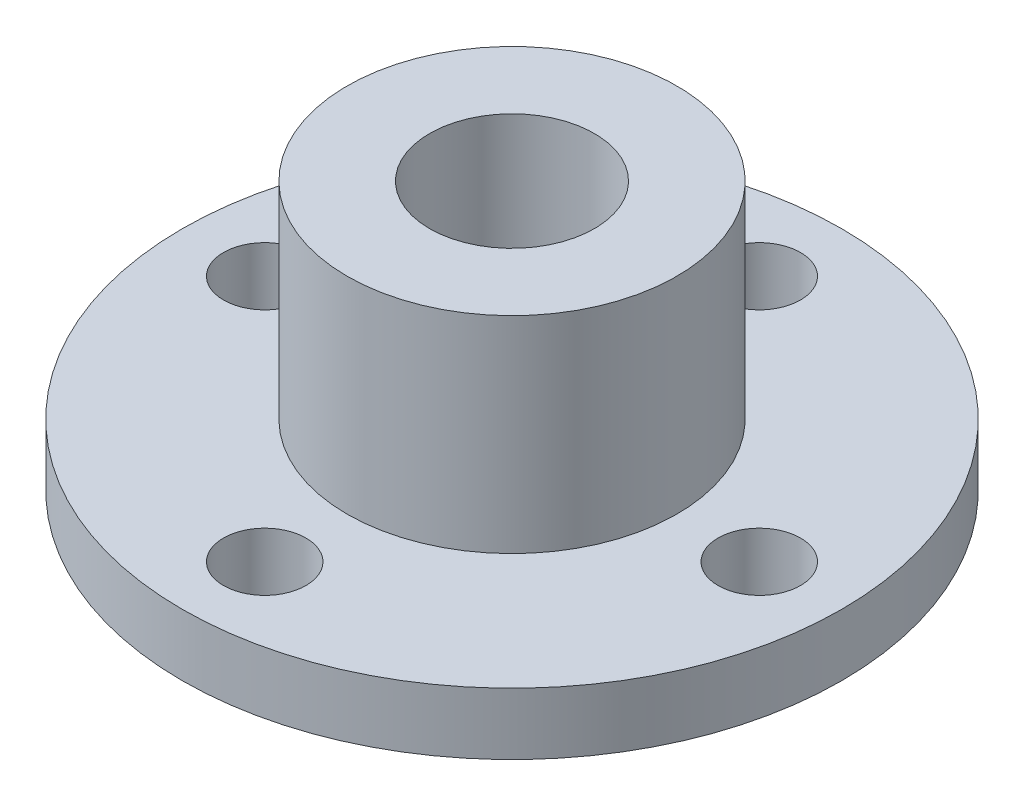
ISO-10303-21;
HEADER;
FILE_DESCRIPTION(('STEP AP214'),'2;1');
FILE_NAME('part.step','',(''),(''),'','','');
FILE_SCHEMA(('AUTOMOTIVE_DESIGN { 1 0 10303 214 1 1 1 1 }'));
ENDSEC;
DATA;
#1=APPLICATION_CONTEXT('core data for automotive mechanical design processes');
#2=APPLICATION_PROTOCOL_DEFINITION('international standard','automotive_design',2000,#1);
#3=PRODUCT_CONTEXT('',#1,'mechanical');
#4=PRODUCT('Part','Part','',(#3));
#5=PRODUCT_RELATED_PRODUCT_CATEGORY('part','',(#4));
#6=PRODUCT_DEFINITION_FORMATION('','',#4);
#7=PRODUCT_DEFINITION_CONTEXT('part definition',#1,'design');
#8=PRODUCT_DEFINITION('design','',#6,#7);
#9=PRODUCT_DEFINITION_SHAPE('','',#8);
#10=(LENGTH_UNIT() NAMED_UNIT(*) SI_UNIT(.MILLI.,.METRE.));
#11=(NAMED_UNIT(*) PLANE_ANGLE_UNIT() SI_UNIT($,.RADIAN.));
#12=(NAMED_UNIT(*) SI_UNIT($,.STERADIAN.) SOLID_ANGLE_UNIT());
#13=UNCERTAINTY_MEASURE_WITH_UNIT(LENGTH_MEASURE(1.E-05),#10,'distance_accuracy_value','');
#14=(GEOMETRIC_REPRESENTATION_CONTEXT(3) GLOBAL_UNCERTAINTY_ASSIGNED_CONTEXT((#13)) GLOBAL_UNIT_ASSIGNED_CONTEXT((#10,
#11,#12)) REPRESENTATION_CONTEXT('',''));
#15=CARTESIAN_POINT('',(0.,0.,0.));
#16=DIRECTION('',(0.,0.,1.));
#17=DIRECTION('',(1.,0.,0.));
#18=AXIS2_PLACEMENT_3D('',#15,#16,#17);
#19=CARTESIAN_POINT('',(0.,3.,-12.));
#20=DIRECTION('',(0.,-1.,0.));
#21=DIRECTION('',(0.,0.,-1.));
#22=AXIS2_PLACEMENT_3D('',#19,#20,#21);
#23=CYLINDRICAL_SURFACE('',#22,2.);
#24=CARTESIAN_POINT('',(0.,3.,-12.));
#25=DIRECTION('',(0.,1.,0.));
#26=DIRECTION('',(0.,0.,1.));
#27=AXIS2_PLACEMENT_3D('',#24,#25,#26);
#28=CIRCLE('',#27,2.);
#29=CARTESIAN_POINT('',(0.,3.,-10.));
#30=VERTEX_POINT('',#29);
#31=EDGE_CURVE('E44',#30,#30,#28,.T.);
#32=ORIENTED_EDGE('',*,*,#31,.T.);
#33=EDGE_LOOP('',(#32));
#34=FACE_BOUND('',#33,.T.);
#35=CARTESIAN_POINT('',(0.,0.,-12.));
#36=DIRECTION('',(0.,1.,0.));
#37=DIRECTION('',(0.,0.,1.));
#38=AXIS2_PLACEMENT_3D('',#35,#36,#37);
#39=CIRCLE('',#38,2.);
#40=CARTESIAN_POINT('',(0.,0.,-10.));
#41=VERTEX_POINT('',#40);
#42=EDGE_CURVE('E51',#41,#41,#39,.T.);
#43=ORIENTED_EDGE('',*,*,#42,.F.);
#44=EDGE_LOOP('',(#43));
#45=FACE_BOUND('',#44,.T.);
#46=ADVANCED_FACE('F32',(#34,#45),#23,.F.);
#47=CARTESIAN_POINT('',(12.,3.,0.));
#48=DIRECTION('',(0.,-1.,0.));
#49=DIRECTION('',(0.,0.,-1.));
#50=AXIS2_PLACEMENT_3D('',#47,#48,#49);
#51=CYLINDRICAL_SURFACE('',#50,2.);
#52=CARTESIAN_POINT('',(12.,3.,0.));
#53=DIRECTION('',(0.,1.,0.));
#54=DIRECTION('',(0.,0.,1.));
#55=AXIS2_PLACEMENT_3D('',#52,#53,#54);
#56=CIRCLE('',#55,2.);
#57=CARTESIAN_POINT('',(12.,3.,2.));
#58=VERTEX_POINT('',#57);
#59=EDGE_CURVE('E63',#58,#58,#56,.T.);
#60=ORIENTED_EDGE('',*,*,#59,.T.);
#61=EDGE_LOOP('',(#60));
#62=FACE_BOUND('',#61,.T.);
#63=CARTESIAN_POINT('',(12.,0.,0.));
#64=DIRECTION('',(0.,1.,0.));
#65=DIRECTION('',(0.,0.,1.));
#66=AXIS2_PLACEMENT_3D('',#63,#64,#65);
#67=CIRCLE('',#66,2.);
#68=CARTESIAN_POINT('',(12.,0.,2.));
#69=VERTEX_POINT('',#68);
#70=EDGE_CURVE('E54',#69,#69,#67,.T.);
#71=ORIENTED_EDGE('',*,*,#70,.F.);
#72=EDGE_LOOP('',(#71));
#73=FACE_BOUND('',#72,.T.);
#74=ADVANCED_FACE('F99',(#62,#73),#51,.F.);
#75=CARTESIAN_POINT('',(0.,3.,0.));
#76=DIRECTION('',(0.,-1.,0.));
#77=DIRECTION('',(0.,0.,-1.));
#78=AXIS2_PLACEMENT_3D('',#75,#76,#77);
#79=CYLINDRICAL_SURFACE('',#78,16.);
#80=CARTESIAN_POINT('',(0.,3.,0.));
#81=DIRECTION('',(0.,1.,0.));
#82=DIRECTION('',(0.,0.,1.));
#83=AXIS2_PLACEMENT_3D('',#80,#81,#82);
#84=CIRCLE('',#83,16.);
#85=CARTESIAN_POINT('',(0.,3.,16.));
#86=VERTEX_POINT('',#85);
#87=EDGE_CURVE('E50',#86,#86,#84,.T.);
#88=ORIENTED_EDGE('',*,*,#87,.F.);
#89=EDGE_LOOP('',(#88));
#90=FACE_BOUND('',#89,.T.);
#91=CARTESIAN_POINT('',(0.,0.,0.));
#92=DIRECTION('',(0.,1.,0.));
#93=DIRECTION('',(0.,0.,1.));
#94=AXIS2_PLACEMENT_3D('',#91,#92,#93);
#95=CIRCLE('',#94,16.);
#96=CARTESIAN_POINT('',(0.,0.,16.));
#97=VERTEX_POINT('',#96);
#98=EDGE_CURVE('E57',#97,#97,#95,.T.);
#99=ORIENTED_EDGE('',*,*,#98,.T.);
#100=EDGE_LOOP('',(#99));
#101=FACE_BOUND('',#100,.T.);
#102=ADVANCED_FACE('F34',(#90,#101),#79,.T.);
#103=CARTESIAN_POINT('',(-12.,3.,0.));
#104=DIRECTION('',(0.,-1.,0.));
#105=DIRECTION('',(0.,0.,-1.));
#106=AXIS2_PLACEMENT_3D('',#103,#104,#105);
#107=CYLINDRICAL_SURFACE('',#106,2.);
#108=CARTESIAN_POINT('',(-12.,3.,0.));
#109=DIRECTION('',(0.,1.,0.));
#110=DIRECTION('',(0.,0.,1.));
#111=AXIS2_PLACEMENT_3D('',#108,#109,#110);
#112=CIRCLE('',#111,2.);
#113=CARTESIAN_POINT('',(-12.,3.,2.));
#114=VERTEX_POINT('',#113);
#115=EDGE_CURVE('E40',#114,#114,#112,.T.);
#116=ORIENTED_EDGE('',*,*,#115,.T.);
#117=EDGE_LOOP('',(#116));
#118=FACE_BOUND('',#117,.T.);
#119=CARTESIAN_POINT('',(-12.,0.,0.));
#120=DIRECTION('',(0.,1.,0.));
#121=DIRECTION('',(0.,0.,1.));
#122=AXIS2_PLACEMENT_3D('',#119,#120,#121);
#123=CIRCLE('',#122,2.);
#124=CARTESIAN_POINT('',(-12.,0.,2.));
#125=VERTEX_POINT('',#124);
#126=EDGE_CURVE('E47',#125,#125,#123,.T.);
#127=ORIENTED_EDGE('',*,*,#126,.F.);
#128=EDGE_LOOP('',(#127));
#129=FACE_BOUND('',#128,.T.);
#130=ADVANCED_FACE('F108',(#118,#129),#107,.F.);
#131=CARTESIAN_POINT('',(0.,3.,0.));
#132=DIRECTION('',(0.,1.,0.));
#133=DIRECTION('',(0.,0.,1.));
#134=AXIS2_PLACEMENT_3D('',#131,#132,#133);
#135=PLANE('',#134);
#136=CARTESIAN_POINT('',(0.,3.,12.));
#137=DIRECTION('',(0.,1.,0.));
#138=DIRECTION('',(0.,0.,1.));
#139=AXIS2_PLACEMENT_3D('',#136,#137,#138);
#140=CIRCLE('',#139,2.);
#141=CARTESIAN_POINT('',(0.,3.,14.));
#142=VERTEX_POINT('',#141);
#143=EDGE_CURVE('E76',#142,#142,#140,.T.);
#144=ORIENTED_EDGE('',*,*,#143,.F.);
#145=EDGE_LOOP('',(#144));
#146=FACE_BOUND('',#145,.T.);
#147=CARTESIAN_POINT('',(0.,3.,0.));
#148=DIRECTION('',(0.,1.,0.));
#149=DIRECTION('',(0.,0.,1.));
#150=AXIS2_PLACEMENT_3D('',#147,#148,#149);
#151=CIRCLE('',#150,8.);
#152=CARTESIAN_POINT('',(0.,3.,8.));
#153=VERTEX_POINT('',#152);
#154=EDGE_CURVE('E68',#153,#153,#151,.T.);
#155=ORIENTED_EDGE('',*,*,#154,.F.);
#156=EDGE_LOOP('',(#155));
#157=FACE_BOUND('',#156,.T.);
#158=ORIENTED_EDGE('',*,*,#87,.T.);
#159=EDGE_LOOP('',(#158));
#160=FACE_BOUND('',#159,.T.);
#161=ORIENTED_EDGE('',*,*,#59,.F.);
#162=EDGE_LOOP('',(#161));
#163=FACE_BOUND('',#162,.T.);
#164=ORIENTED_EDGE('',*,*,#31,.F.);
#165=EDGE_LOOP('',(#164));
#166=FACE_BOUND('',#165,.T.);
#167=ORIENTED_EDGE('',*,*,#115,.F.);
#168=EDGE_LOOP('',(#167));
#169=FACE_BOUND('',#168,.T.);
#170=ADVANCED_FACE('F96',(#146,#157,#160,#163,#166,#169),#135,.T.);
#171=CARTESIAN_POINT('',(0.,0.,0.));
#172=DIRECTION('',(0.,1.,0.));
#173=DIRECTION('',(0.,0.,1.));
#174=AXIS2_PLACEMENT_3D('',#171,#172,#173);
#175=PLANE('',#174);
#176=CARTESIAN_POINT('',(0.,0.,12.));
#177=DIRECTION('',(0.,1.,0.));
#178=DIRECTION('',(0.,0.,1.));
#179=AXIS2_PLACEMENT_3D('',#176,#177,#178);
#180=CIRCLE('',#179,2.);
#181=CARTESIAN_POINT('',(0.,0.,14.));
#182=VERTEX_POINT('',#181);
#183=EDGE_CURVE('E36',#182,#182,#180,.T.);
#184=ORIENTED_EDGE('',*,*,#183,.T.);
#185=EDGE_LOOP('',(#184));
#186=FACE_BOUND('',#185,.T.);
#187=ORIENTED_EDGE('',*,*,#98,.F.);
#188=EDGE_LOOP('',(#187));
#189=FACE_BOUND('',#188,.T.);
#190=ORIENTED_EDGE('',*,*,#70,.T.);
#191=EDGE_LOOP('',(#190));
#192=FACE_BOUND('',#191,.T.);
#193=ORIENTED_EDGE('',*,*,#42,.T.);
#194=EDGE_LOOP('',(#193));
#195=FACE_BOUND('',#194,.T.);
#196=ORIENTED_EDGE('',*,*,#126,.T.);
#197=EDGE_LOOP('',(#196));
#198=FACE_BOUND('',#197,.T.);
#199=ADVANCED_FACE('F83',(#186,#189,#192,#195,#198),#175,.F.);
#200=CARTESIAN_POINT('',(0.,13.,0.));
#201=DIRECTION('',(0.,1.,0.));
#202=DIRECTION('',(0.,0.,1.));
#203=AXIS2_PLACEMENT_3D('',#200,#201,#202);
#204=PLANE('',#203);
#205=CARTESIAN_POINT('',(0.,13.,0.));
#206=DIRECTION('',(0.,1.,0.));
#207=DIRECTION('',(0.,0.,1.));
#208=AXIS2_PLACEMENT_3D('',#205,#206,#207);
#209=CIRCLE('',#208,8.);
#210=CARTESIAN_POINT('',(0.,13.,8.));
#211=VERTEX_POINT('',#210);
#212=EDGE_CURVE('E59',#211,#211,#209,.T.);
#213=ORIENTED_EDGE('',*,*,#212,.T.);
#214=EDGE_LOOP('',(#213));
#215=FACE_BOUND('',#214,.T.);
#216=CARTESIAN_POINT('',(0.,13.,0.));
#217=DIRECTION('',(0.,1.,0.));
#218=DIRECTION('',(0.,0.,1.));
#219=AXIS2_PLACEMENT_3D('',#216,#217,#218);
#220=CIRCLE('',#219,4.);
#221=CARTESIAN_POINT('',(0.,13.,4.));
#222=VERTEX_POINT('',#221);
#223=EDGE_CURVE('E71',#222,#222,#220,.T.);
#224=ORIENTED_EDGE('',*,*,#223,.F.);
#225=EDGE_LOOP('',(#224));
#226=FACE_BOUND('',#225,.T.);
#227=ADVANCED_FACE('F113',(#215,#226),#204,.T.);
#228=CARTESIAN_POINT('',(0.,13.,0.));
#229=DIRECTION('',(0.,-1.,0.));
#230=DIRECTION('',(0.,0.,-1.));
#231=AXIS2_PLACEMENT_3D('',#228,#229,#230);
#232=CYLINDRICAL_SURFACE('',#231,8.);
#233=ORIENTED_EDGE('',*,*,#212,.F.);
#234=EDGE_LOOP('',(#233));
#235=FACE_BOUND('',#234,.T.);
#236=ORIENTED_EDGE('',*,*,#154,.T.);
#237=EDGE_LOOP('',(#236));
#238=FACE_BOUND('',#237,.T.);
#239=ADVANCED_FACE('F117',(#235,#238),#232,.T.);
#240=CARTESIAN_POINT('',(0.,13.,0.));
#241=DIRECTION('',(0.,-1.,0.));
#242=DIRECTION('',(0.,0.,-1.));
#243=AXIS2_PLACEMENT_3D('',#240,#241,#242);
#244=CYLINDRICAL_SURFACE('',#243,4.);
#245=ORIENTED_EDGE('',*,*,#223,.T.);
#246=EDGE_LOOP('',(#245));
#247=FACE_BOUND('',#246,.T.);
#248=CARTESIAN_POINT('',(0.,3.,0.));
#249=DIRECTION('',(0.,1.,0.));
#250=DIRECTION('',(0.,0.,1.));
#251=AXIS2_PLACEMENT_3D('',#248,#249,#250);
#252=CIRCLE('',#251,4.);
#253=CARTESIAN_POINT('',(0.,3.,4.));
#254=VERTEX_POINT('',#253);
#255=EDGE_CURVE('E10',#254,#254,#252,.F.);
#256=ORIENTED_EDGE('',*,*,#255,.T.);
#257=EDGE_LOOP('',(#256));
#258=FACE_BOUND('',#257,.T.);
#259=ADVANCED_FACE('F93',(#247,#258),#244,.F.);
#260=ORIENTED_EDGE('',*,*,#255,.F.);
#261=EDGE_LOOP('',(#260));
#262=FACE_BOUND('',#261,.T.);
#263=ADVANCED_FACE('F88',(#262),#135,.T.);
#264=CARTESIAN_POINT('',(0.,-56.,12.));
#265=DIRECTION('',(0.,1.,0.));
#266=DIRECTION('',(0.,0.,1.));
#267=AXIS2_PLACEMENT_3D('',#264,#265,#266);
#268=CYLINDRICAL_SURFACE('',#267,2.);
#269=ORIENTED_EDGE('',*,*,#143,.T.);
#270=EDGE_LOOP('',(#269));
#271=FACE_BOUND('',#270,.T.);
#272=ORIENTED_EDGE('',*,*,#183,.F.);
#273=EDGE_LOOP('',(#272));
#274=FACE_BOUND('',#273,.T.);
#275=ADVANCED_FACE('F86',(#271,#274),#268,.F.);
#276=CLOSED_SHELL('',(#46,#74,#102,#130,#170,#199,#227,#239,#259,#263,#275));
#277=MANIFOLD_SOLID_BREP('B2',#276);
#278=ADVANCED_BREP_SHAPE_REPRESENTATION('',(#18,#277),#14);
#279=SHAPE_DEFINITION_REPRESENTATION(#9,#278);
ENDSEC;
END-ISO-10303-21;
